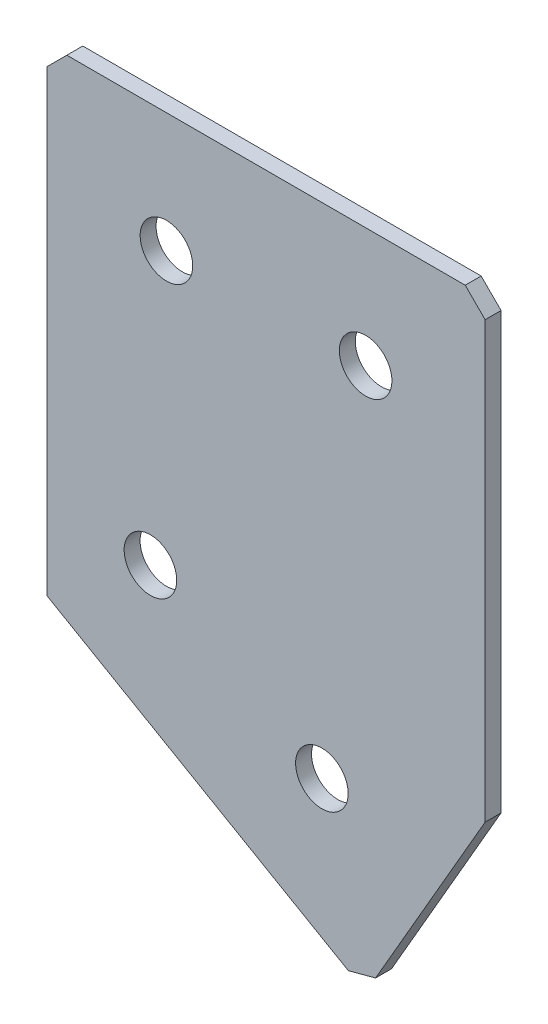
ISO-10303-21;
HEADER;
FILE_DESCRIPTION(('STEP AP214'),'2;1');
FILE_NAME('part.step','',(''),(''),'','','');
FILE_SCHEMA(('AUTOMOTIVE_DESIGN { 1 0 10303 214 1 1 1 1 }'));
ENDSEC;
DATA;
#1=APPLICATION_CONTEXT('core data for automotive mechanical design processes');
#2=APPLICATION_PROTOCOL_DEFINITION('international standard','automotive_design',2000,#1);
#3=PRODUCT_CONTEXT('',#1,'mechanical');
#4=PRODUCT('Part','Part','',(#3));
#5=PRODUCT_RELATED_PRODUCT_CATEGORY('part','',(#4));
#6=PRODUCT_DEFINITION_FORMATION('','',#4);
#7=PRODUCT_DEFINITION_CONTEXT('part definition',#1,'design');
#8=PRODUCT_DEFINITION('design','',#6,#7);
#9=PRODUCT_DEFINITION_SHAPE('','',#8);
#10=(LENGTH_UNIT() NAMED_UNIT(*) SI_UNIT(.MILLI.,.METRE.));
#11=(NAMED_UNIT(*) PLANE_ANGLE_UNIT() SI_UNIT($,.RADIAN.));
#12=(NAMED_UNIT(*) SI_UNIT($,.STERADIAN.) SOLID_ANGLE_UNIT());
#13=UNCERTAINTY_MEASURE_WITH_UNIT(LENGTH_MEASURE(1.E-05),#10,'distance_accuracy_value','');
#14=(GEOMETRIC_REPRESENTATION_CONTEXT(3) GLOBAL_UNCERTAINTY_ASSIGNED_CONTEXT((#13)) GLOBAL_UNIT_ASSIGNED_CONTEXT((#10,
#11,#12)) REPRESENTATION_CONTEXT('',''));
#15=CARTESIAN_POINT('',(0.,0.,0.));
#16=DIRECTION('',(0.,0.,1.));
#17=DIRECTION('',(1.,0.,0.));
#18=AXIS2_PLACEMENT_3D('',#15,#16,#17);
#19=CARTESIAN_POINT('',(0.,0.,-2.));
#20=DIRECTION('',(1.,0.,0.));
#21=DIRECTION('',(0.,0.,-1.));
#22=AXIS2_PLACEMENT_3D('',#19,#20,#21);
#23=PLANE('',#22);
#24=DIRECTION('',(0.,1.,0.));
#25=VECTOR('',#24,1.);
#26=CARTESIAN_POINT('',(0.,0.,0.));
#27=LINE('',#26,#25);
#28=CARTESIAN_POINT('',(0.,-60.,0.));
#29=VERTEX_POINT('',#28);
#30=CARTESIAN_POINT('',(0.,-2.50000000000002,0.));
#31=VERTEX_POINT('',#30);
#32=EDGE_CURVE('E130',#29,#31,#27,.T.);
#33=ORIENTED_EDGE('',*,*,#32,.T.);
#34=DIRECTION('',(0.,0.,-1.));
#35=VECTOR('',#34,1.);
#36=CARTESIAN_POINT('',(0.,-2.50000000000002,-2.));
#37=LINE('',#36,#35);
#38=CARTESIAN_POINT('',(0.,-2.50000000000002,-2.));
#39=VERTEX_POINT('',#38);
#40=EDGE_CURVE('E11',#31,#39,#37,.T.);
#41=ORIENTED_EDGE('',*,*,#40,.T.);
#42=DIRECTION('',(0.,1.,0.));
#43=VECTOR('',#42,1.);
#44=CARTESIAN_POINT('',(0.,0.,-2.));
#45=LINE('',#44,#43);
#46=CARTESIAN_POINT('',(0.,-60.,-2.));
#47=VERTEX_POINT('',#46);
#48=EDGE_CURVE('E141',#47,#39,#45,.T.);
#49=ORIENTED_EDGE('',*,*,#48,.F.);
#50=DIRECTION('',(0.,0.,1.));
#51=VECTOR('',#50,1.);
#52=CARTESIAN_POINT('',(0.,-60.,-2.));
#53=LINE('',#52,#51);
#54=EDGE_CURVE('E120',#47,#29,#53,.T.);
#55=ORIENTED_EDGE('',*,*,#54,.T.);
#56=EDGE_LOOP('',(#33,#41,#49,#55));
#57=FACE_BOUND('',#56,.T.);
#58=ADVANCED_FACE('F37',(#57),#23,.F.);
#59=CARTESIAN_POINT('',(0.,0.,-2.));
#60=DIRECTION('',(0.,-1.,0.));
#61=DIRECTION('',(0.,0.,-1.));
#62=AXIS2_PLACEMENT_3D('',#59,#60,#61);
#63=PLANE('',#62);
#64=DIRECTION('',(1.,0.,0.));
#65=VECTOR('',#64,1.);
#66=CARTESIAN_POINT('',(0.,0.,0.));
#67=LINE('',#66,#65);
#68=CARTESIAN_POINT('',(2.50000000000002,0.,0.));
#69=VERTEX_POINT('',#68);
#70=CARTESIAN_POINT('',(52.5,0.,0.));
#71=VERTEX_POINT('',#70);
#72=EDGE_CURVE('E133',#69,#71,#67,.T.);
#73=ORIENTED_EDGE('',*,*,#72,.T.);
#74=DIRECTION('',(0.,0.,-1.));
#75=VECTOR('',#74,1.);
#76=CARTESIAN_POINT('',(52.5,0.,-2.));
#77=LINE('',#76,#75);
#78=CARTESIAN_POINT('',(52.5,0.,-2.));
#79=VERTEX_POINT('',#78);
#80=EDGE_CURVE('E45',#71,#79,#77,.T.);
#81=ORIENTED_EDGE('',*,*,#80,.T.);
#82=DIRECTION('',(1.,0.,0.));
#83=VECTOR('',#82,1.);
#84=CARTESIAN_POINT('',(0.,0.,-2.));
#85=LINE('',#84,#83);
#86=CARTESIAN_POINT('',(2.50000000000002,0.,-2.));
#87=VERTEX_POINT('',#86);
#88=EDGE_CURVE('E109',#87,#79,#85,.T.);
#89=ORIENTED_EDGE('',*,*,#88,.F.);
#90=DIRECTION('',(0.,0.,1.));
#91=VECTOR('',#90,1.);
#92=CARTESIAN_POINT('',(2.50000000000002,0.,-2.));
#93=LINE('',#92,#91);
#94=EDGE_CURVE('E160',#87,#69,#93,.T.);
#95=ORIENTED_EDGE('',*,*,#94,.T.);
#96=EDGE_LOOP('',(#73,#81,#89,#95));
#97=FACE_BOUND('',#96,.T.);
#98=ADVANCED_FACE('F164',(#97),#63,.F.);
#99=CARTESIAN_POINT('',(55.,0.,-2.));
#100=DIRECTION('',(-1.,0.,0.));
#101=DIRECTION('',(0.,0.,1.));
#102=AXIS2_PLACEMENT_3D('',#99,#100,#101);
#103=PLANE('',#102);
#104=DIRECTION('',(0.,-1.,0.));
#105=VECTOR('',#104,1.);
#106=CARTESIAN_POINT('',(55.,0.,-2.));
#107=LINE('',#106,#105);
#108=CARTESIAN_POINT('',(55.,-2.50000000000002,-2.));
#109=VERTEX_POINT('',#108);
#110=CARTESIAN_POINT('',(55.,-57.113248654052,-2.));
#111=VERTEX_POINT('',#110);
#112=EDGE_CURVE('E100',#109,#111,#107,.T.);
#113=ORIENTED_EDGE('',*,*,#112,.F.);
#114=DIRECTION('',(0.,0.,1.));
#115=VECTOR('',#114,1.);
#116=CARTESIAN_POINT('',(55.,-2.50000000000002,-2.));
#117=LINE('',#116,#115);
#118=CARTESIAN_POINT('',(55.,-2.50000000000002,0.));
#119=VERTEX_POINT('',#118);
#120=EDGE_CURVE('E158',#109,#119,#117,.T.);
#121=ORIENTED_EDGE('',*,*,#120,.T.);
#122=DIRECTION('',(0.,-1.,0.));
#123=VECTOR('',#122,1.);
#124=CARTESIAN_POINT('',(55.,0.,0.));
#125=LINE('',#124,#123);
#126=CARTESIAN_POINT('',(55.,-57.113248654052,0.));
#127=VERTEX_POINT('',#126);
#128=EDGE_CURVE('E115',#119,#127,#125,.T.);
#129=ORIENTED_EDGE('',*,*,#128,.T.);
#130=DIRECTION('',(0.,0.,1.));
#131=VECTOR('',#130,1.);
#132=CARTESIAN_POINT('',(55.,-57.113248654052,-2.));
#133=LINE('',#132,#131);
#134=EDGE_CURVE('E112',#111,#127,#133,.T.);
#135=ORIENTED_EDGE('',*,*,#134,.F.);
#136=EDGE_LOOP('',(#113,#121,#129,#135));
#137=FACE_BOUND('',#136,.T.);
#138=ADVANCED_FACE('F113',(#137),#103,.F.);
#139=CARTESIAN_POINT('',(40.,-83.0940107675851,-2.));
#140=DIRECTION('',(-0.866025403784438,0.500000000000001,0.));
#141=DIRECTION('',(-0.500000000000001,-0.866025403784438,0.));
#142=AXIS2_PLACEMENT_3D('',#139,#140,#141);
#143=PLANE('',#142);
#144=DIRECTION('',(-0.500000000000001,-0.866025403784438,0.));
#145=VECTOR('',#144,1.);
#146=CARTESIAN_POINT('',(40.,-83.0940107675851,0.));
#147=LINE('',#146,#145);
#148=CARTESIAN_POINT('',(41.25,-80.928947258124,0.));
#149=VERTEX_POINT('',#148);
#150=EDGE_CURVE('E137',#127,#149,#147,.T.);
#151=ORIENTED_EDGE('',*,*,#150,.T.);
#152=DIRECTION('',(0.,0.,-1.));
#153=VECTOR('',#152,1.);
#154=CARTESIAN_POINT('',(41.25,-80.928947258124,-2.));
#155=LINE('',#154,#153);
#156=CARTESIAN_POINT('',(41.25,-80.928947258124,-2.));
#157=VERTEX_POINT('',#156);
#158=EDGE_CURVE('E124',#149,#157,#155,.T.);
#159=ORIENTED_EDGE('',*,*,#158,.T.);
#160=DIRECTION('',(-0.500000000000001,-0.866025403784438,0.));
#161=VECTOR('',#160,1.);
#162=CARTESIAN_POINT('',(40.,-83.0940107675851,-2.));
#163=LINE('',#162,#161);
#164=EDGE_CURVE('E104',#111,#157,#163,.T.);
#165=ORIENTED_EDGE('',*,*,#164,.F.);
#166=ORIENTED_EDGE('',*,*,#134,.T.);
#167=EDGE_LOOP('',(#151,#159,#165,#166));
#168=FACE_BOUND('',#167,.T.);
#169=ADVANCED_FACE('F122',(#168),#143,.F.);
#170=CARTESIAN_POINT('',(0.,-60.,-2.));
#171=DIRECTION('',(0.500000000000001,0.866025403784438,0.));
#172=DIRECTION('',(-0.866025403784438,0.500000000000001,0.));
#173=AXIS2_PLACEMENT_3D('',#170,#171,#172);
#174=PLANE('',#173);
#175=DIRECTION('',(-0.866025403784438,0.500000000000001,0.));
#176=VECTOR('',#175,1.);
#177=CARTESIAN_POINT('',(0.,-60.,-2.));
#178=LINE('',#177,#176);
#179=CARTESIAN_POINT('',(37.8349364905389,-81.8440107675851,-2.));
#180=VERTEX_POINT('',#179);
#181=EDGE_CURVE('E125',#180,#47,#178,.T.);
#182=ORIENTED_EDGE('',*,*,#181,.F.);
#183=DIRECTION('',(0.,0.,1.));
#184=VECTOR('',#183,1.);
#185=CARTESIAN_POINT('',(37.8349364905389,-81.8440107675851,-2.));
#186=LINE('',#185,#184);
#187=CARTESIAN_POINT('',(37.8349364905389,-81.8440107675851,0.));
#188=VERTEX_POINT('',#187);
#189=EDGE_CURVE('E119',#180,#188,#186,.T.);
#190=ORIENTED_EDGE('',*,*,#189,.T.);
#191=DIRECTION('',(-0.866025403784438,0.500000000000001,0.));
#192=VECTOR('',#191,1.);
#193=CARTESIAN_POINT('',(0.,-60.,0.));
#194=LINE('',#193,#192);
#195=EDGE_CURVE('E139',#188,#29,#194,.T.);
#196=ORIENTED_EDGE('',*,*,#195,.T.);
#197=ORIENTED_EDGE('',*,*,#54,.F.);
#198=EDGE_LOOP('',(#182,#190,#196,#197));
#199=FACE_BOUND('',#198,.T.);
#200=ADVANCED_FACE('F194',(#199),#174,.F.);
#201=CARTESIAN_POINT('',(0.,0.,-2.));
#202=DIRECTION('',(0.,0.,1.));
#203=DIRECTION('',(1.,0.,0.));
#204=AXIS2_PLACEMENT_3D('',#201,#202,#203);
#205=PLANE('',#204);
#206=CARTESIAN_POINT('',(15.,-15.,-2.));
#207=DIRECTION('',(0.,0.,-1.));
#208=DIRECTION('',(0.,1.,0.));
#209=AXIS2_PLACEMENT_3D('',#206,#207,#208);
#210=CIRCLE('',#209,3.3);
#211=CARTESIAN_POINT('',(15.,-11.7,-2.));
#212=VERTEX_POINT('',#211);
#213=EDGE_CURVE('E226',#212,#212,#210,.T.);
#214=ORIENTED_EDGE('',*,*,#213,.F.);
#215=EDGE_LOOP('',(#214));
#216=FACE_BOUND('',#215,.T.);
#217=CARTESIAN_POINT('',(40.,-15.,-2.));
#218=DIRECTION('',(0.,0.,-1.));
#219=DIRECTION('',(0.,1.,0.));
#220=AXIS2_PLACEMENT_3D('',#217,#218,#219);
#221=CIRCLE('',#220,3.3);
#222=CARTESIAN_POINT('',(40.,-11.7,-2.));
#223=VERTEX_POINT('',#222);
#224=EDGE_CURVE('E228',#223,#223,#221,.T.);
#225=ORIENTED_EDGE('',*,*,#224,.F.);
#226=EDGE_LOOP('',(#225));
#227=FACE_BOUND('',#226,.T.);
#228=CARTESIAN_POINT('',(12.9903810567666,-50.1794919243113,-2.));
#229=DIRECTION('',(0.,0.,-1.));
#230=DIRECTION('',(0.,1.,0.));
#231=AXIS2_PLACEMENT_3D('',#228,#229,#230);
#232=CIRCLE('',#231,3.3);
#233=CARTESIAN_POINT('',(12.9903810567666,-46.8794919243113,-2.));
#234=VERTEX_POINT('',#233);
#235=EDGE_CURVE('E236',#234,#234,#232,.T.);
#236=ORIENTED_EDGE('',*,*,#235,.F.);
#237=EDGE_LOOP('',(#236));
#238=FACE_BOUND('',#237,.T.);
#239=CARTESIAN_POINT('',(34.5096189432334,-62.6036297108185,-2.));
#240=DIRECTION('',(0.,0.,-1.));
#241=DIRECTION('',(0.,1.,0.));
#242=AXIS2_PLACEMENT_3D('',#239,#240,#241);
#243=CIRCLE('',#242,3.3);
#244=CARTESIAN_POINT('',(34.5096189432334,-59.3036297108185,-2.));
#245=VERTEX_POINT('',#244);
#246=EDGE_CURVE('E242',#245,#245,#243,.T.);
#247=ORIENTED_EDGE('',*,*,#246,.F.);
#248=EDGE_LOOP('',(#247));
#249=FACE_BOUND('',#248,.T.);
#250=ORIENTED_EDGE('',*,*,#164,.T.);
#251=DIRECTION('',(0.965925826289069,0.258819045102517,0.));
#252=VECTOR('',#251,1.);
#253=CARTESIAN_POINT('',(37.8349364905389,-81.8440107675851,-2.));
#254=LINE('',#253,#252);
#255=EDGE_CURVE('E156',#157,#180,#254,.F.);
#256=ORIENTED_EDGE('',*,*,#255,.T.);
#257=ORIENTED_EDGE('',*,*,#181,.T.);
#258=ORIENTED_EDGE('',*,*,#48,.T.);
#259=DIRECTION('',(-0.707106781186548,-0.707106781186548,0.));
#260=VECTOR('',#259,1.);
#261=CARTESIAN_POINT('',(2.50000000000002,0.,-2.));
#262=LINE('',#261,#260);
#263=EDGE_CURVE('E153',#39,#87,#262,.F.);
#264=ORIENTED_EDGE('',*,*,#263,.T.);
#265=ORIENTED_EDGE('',*,*,#88,.T.);
#266=DIRECTION('',(-0.707106781186548,0.707106781186548,0.));
#267=VECTOR('',#266,1.);
#268=CARTESIAN_POINT('',(55.,-2.50000000000002,-2.));
#269=LINE('',#268,#267);
#270=EDGE_CURVE('E52',#79,#109,#269,.F.);
#271=ORIENTED_EDGE('',*,*,#270,.T.);
#272=ORIENTED_EDGE('',*,*,#112,.T.);
#273=EDGE_LOOP('',(#250,#256,#257,#258,#264,#265,#271,#272));
#274=FACE_BOUND('',#273,.T.);
#275=ADVANCED_FACE('F102',(#216,#227,#238,#249,#274),#205,.F.);
#276=CARTESIAN_POINT('',(0.,0.,0.));
#277=DIRECTION('',(0.,0.,1.));
#278=DIRECTION('',(1.,0.,0.));
#279=AXIS2_PLACEMENT_3D('',#276,#277,#278);
#280=PLANE('',#279);
#281=CARTESIAN_POINT('',(15.,-15.,0.));
#282=DIRECTION('',(0.,0.,-1.));
#283=DIRECTION('',(0.,1.,0.));
#284=AXIS2_PLACEMENT_3D('',#281,#282,#283);
#285=CIRCLE('',#284,3.3);
#286=CARTESIAN_POINT('',(15.,-11.7,0.));
#287=VERTEX_POINT('',#286);
#288=EDGE_CURVE('E223',#287,#287,#285,.T.);
#289=ORIENTED_EDGE('',*,*,#288,.T.);
#290=EDGE_LOOP('',(#289));
#291=FACE_BOUND('',#290,.T.);
#292=CARTESIAN_POINT('',(40.,-15.,0.));
#293=DIRECTION('',(0.,0.,-1.));
#294=DIRECTION('',(0.,1.,0.));
#295=AXIS2_PLACEMENT_3D('',#292,#293,#294);
#296=CIRCLE('',#295,3.3);
#297=CARTESIAN_POINT('',(40.,-11.7,0.));
#298=VERTEX_POINT('',#297);
#299=EDGE_CURVE('E233',#298,#298,#296,.T.);
#300=ORIENTED_EDGE('',*,*,#299,.T.);
#301=EDGE_LOOP('',(#300));
#302=FACE_BOUND('',#301,.T.);
#303=CARTESIAN_POINT('',(12.9903810567666,-50.1794919243113,0.));
#304=DIRECTION('',(0.,0.,-1.));
#305=DIRECTION('',(0.,1.,0.));
#306=AXIS2_PLACEMENT_3D('',#303,#304,#305);
#307=CIRCLE('',#306,3.3);
#308=CARTESIAN_POINT('',(12.9903810567666,-46.8794919243113,0.));
#309=VERTEX_POINT('',#308);
#310=EDGE_CURVE('E239',#309,#309,#307,.T.);
#311=ORIENTED_EDGE('',*,*,#310,.T.);
#312=EDGE_LOOP('',(#311));
#313=FACE_BOUND('',#312,.T.);
#314=CARTESIAN_POINT('',(34.5096189432334,-62.6036297108185,0.));
#315=DIRECTION('',(0.,0.,-1.));
#316=DIRECTION('',(0.,1.,0.));
#317=AXIS2_PLACEMENT_3D('',#314,#315,#316);
#318=CIRCLE('',#317,3.3);
#319=CARTESIAN_POINT('',(34.5096189432334,-59.3036297108185,0.));
#320=VERTEX_POINT('',#319);
#321=EDGE_CURVE('E134',#320,#320,#318,.T.);
#322=ORIENTED_EDGE('',*,*,#321,.T.);
#323=EDGE_LOOP('',(#322));
#324=FACE_BOUND('',#323,.T.);
#325=ORIENTED_EDGE('',*,*,#195,.F.);
#326=DIRECTION('',(-0.965925826289069,-0.258819045102517,0.));
#327=VECTOR('',#326,1.);
#328=CARTESIAN_POINT('',(22.9954628614766,-85.8202357425952,0.));
#329=LINE('',#328,#327);
#330=EDGE_CURVE('E150',#188,#149,#329,.F.);
#331=ORIENTED_EDGE('',*,*,#330,.T.);
#332=ORIENTED_EDGE('',*,*,#150,.F.);
#333=ORIENTED_EDGE('',*,*,#128,.F.);
#334=DIRECTION('',(0.707106781186548,-0.707106781186548,0.));
#335=VECTOR('',#334,1.);
#336=CARTESIAN_POINT('',(26.25,26.25,0.));
#337=LINE('',#336,#335);
#338=EDGE_CURVE('E148',#119,#71,#337,.F.);
#339=ORIENTED_EDGE('',*,*,#338,.T.);
#340=ORIENTED_EDGE('',*,*,#72,.F.);
#341=DIRECTION('',(0.707106781186548,0.707106781186548,0.));
#342=VECTOR('',#341,1.);
#343=CARTESIAN_POINT('',(1.25000000000001,-1.25000000000001,0.));
#344=LINE('',#343,#342);
#345=EDGE_CURVE('E146',#69,#31,#344,.F.);
#346=ORIENTED_EDGE('',*,*,#345,.T.);
#347=ORIENTED_EDGE('',*,*,#32,.F.);
#348=EDGE_LOOP('',(#325,#331,#332,#333,#339,#340,#346,#347));
#349=FACE_BOUND('',#348,.T.);
#350=ADVANCED_FACE('F169',(#291,#302,#313,#324,#349),#280,.T.);
#351=CARTESIAN_POINT('',(34.5096189432334,-62.6036297108185,-2.));
#352=DIRECTION('',(0.,0.,-1.));
#353=DIRECTION('',(0.,1.,0.));
#354=AXIS2_PLACEMENT_3D('',#351,#352,#353);
#355=CYLINDRICAL_SURFACE('',#354,3.3);
#356=ORIENTED_EDGE('',*,*,#321,.F.);
#357=EDGE_LOOP('',(#356));
#358=FACE_BOUND('',#357,.T.);
#359=ORIENTED_EDGE('',*,*,#246,.T.);
#360=EDGE_LOOP('',(#359));
#361=FACE_BOUND('',#360,.T.);
#362=ADVANCED_FACE('F200',(#358,#361),#355,.F.);
#363=CARTESIAN_POINT('',(12.9903810567666,-50.1794919243113,-2.));
#364=DIRECTION('',(0.,0.,-1.));
#365=DIRECTION('',(0.,1.,0.));
#366=AXIS2_PLACEMENT_3D('',#363,#364,#365);
#367=CYLINDRICAL_SURFACE('',#366,3.3);
#368=ORIENTED_EDGE('',*,*,#310,.F.);
#369=EDGE_LOOP('',(#368));
#370=FACE_BOUND('',#369,.T.);
#371=ORIENTED_EDGE('',*,*,#235,.T.);
#372=EDGE_LOOP('',(#371));
#373=FACE_BOUND('',#372,.T.);
#374=ADVANCED_FACE('F207',(#370,#373),#367,.F.);
#375=CARTESIAN_POINT('',(40.,-15.,-2.));
#376=DIRECTION('',(0.,0.,-1.));
#377=DIRECTION('',(0.,1.,0.));
#378=AXIS2_PLACEMENT_3D('',#375,#376,#377);
#379=CYLINDRICAL_SURFACE('',#378,3.3);
#380=ORIENTED_EDGE('',*,*,#299,.F.);
#381=EDGE_LOOP('',(#380));
#382=FACE_BOUND('',#381,.T.);
#383=ORIENTED_EDGE('',*,*,#224,.T.);
#384=EDGE_LOOP('',(#383));
#385=FACE_BOUND('',#384,.T.);
#386=ADVANCED_FACE('F211',(#382,#385),#379,.F.);
#387=CARTESIAN_POINT('',(15.,-15.,-2.));
#388=DIRECTION('',(0.,0.,-1.));
#389=DIRECTION('',(0.,1.,0.));
#390=AXIS2_PLACEMENT_3D('',#387,#388,#389);
#391=CYLINDRICAL_SURFACE('',#390,3.3);
#392=ORIENTED_EDGE('',*,*,#288,.F.);
#393=EDGE_LOOP('',(#392));
#394=FACE_BOUND('',#393,.T.);
#395=ORIENTED_EDGE('',*,*,#213,.T.);
#396=EDGE_LOOP('',(#395));
#397=FACE_BOUND('',#396,.T.);
#398=ADVANCED_FACE('F179',(#394,#397),#391,.F.);
#399=CARTESIAN_POINT('',(37.8349364905389,-81.8440107675851,-2.));
#400=DIRECTION('',(-0.258819045102517,0.965925826289069,0.));
#401=DIRECTION('',(0.,0.,1.));
#402=AXIS2_PLACEMENT_3D('',#399,#400,#401);
#403=PLANE('',#402);
#404=ORIENTED_EDGE('',*,*,#255,.F.);
#405=ORIENTED_EDGE('',*,*,#158,.F.);
#406=ORIENTED_EDGE('',*,*,#330,.F.);
#407=ORIENTED_EDGE('',*,*,#189,.F.);
#408=EDGE_LOOP('',(#404,#405,#406,#407));
#409=FACE_BOUND('',#408,.T.);
#410=ADVANCED_FACE('F174',(#409),#403,.F.);
#411=CARTESIAN_POINT('',(55.,-2.50000000000002,-2.));
#412=DIRECTION('',(-0.707106781186547,-0.707106781186547,0.));
#413=DIRECTION('',(0.,0.,1.));
#414=AXIS2_PLACEMENT_3D('',#411,#412,#413);
#415=PLANE('',#414);
#416=ORIENTED_EDGE('',*,*,#270,.F.);
#417=ORIENTED_EDGE('',*,*,#80,.F.);
#418=ORIENTED_EDGE('',*,*,#338,.F.);
#419=ORIENTED_EDGE('',*,*,#120,.F.);
#420=EDGE_LOOP('',(#416,#417,#418,#419));
#421=FACE_BOUND('',#420,.T.);
#422=ADVANCED_FACE('F172',(#421),#415,.F.);
#423=CARTESIAN_POINT('',(2.50000000000002,0.,-2.));
#424=DIRECTION('',(0.707106781186547,-0.707106781186547,0.));
#425=DIRECTION('',(0.,0.,1.));
#426=AXIS2_PLACEMENT_3D('',#423,#424,#425);
#427=PLANE('',#426);
#428=ORIENTED_EDGE('',*,*,#263,.F.);
#429=ORIENTED_EDGE('',*,*,#40,.F.);
#430=ORIENTED_EDGE('',*,*,#345,.F.);
#431=ORIENTED_EDGE('',*,*,#94,.F.);
#432=EDGE_LOOP('',(#428,#429,#430,#431));
#433=FACE_BOUND('',#432,.T.);
#434=ADVANCED_FACE('F39',(#433),#427,.F.);
#435=CLOSED_SHELL('',(#58,#98,#138,#169,#200,#275,#350,#362,#374,#386,#398,#410,#422,#434));
#436=MANIFOLD_SOLID_BREP('B2',#435);
#437=ADVANCED_BREP_SHAPE_REPRESENTATION('',(#18,#436),#14);
#438=SHAPE_DEFINITION_REPRESENTATION(#9,#437);
ENDSEC;
END-ISO-10303-21;
